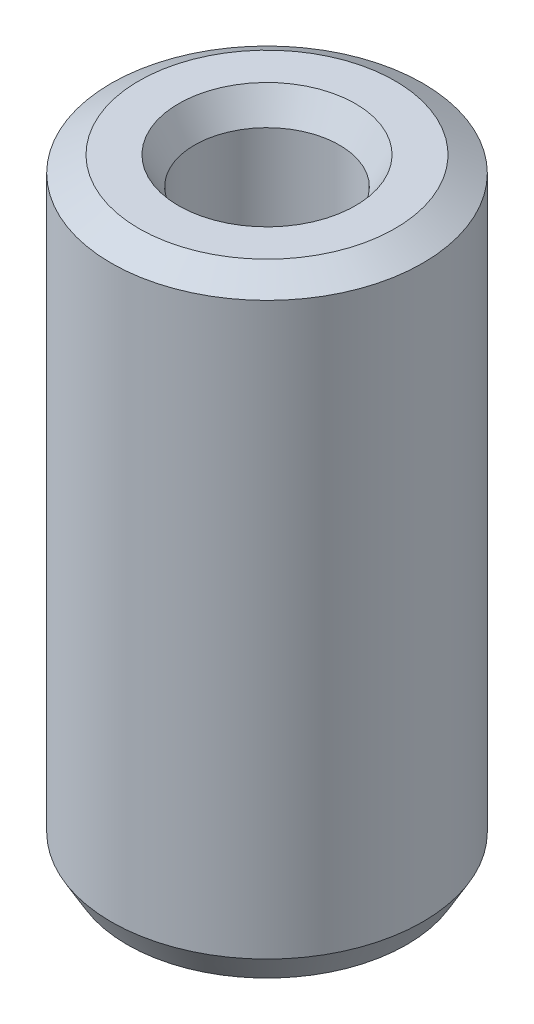
ISO-10303-21;
HEADER;
FILE_DESCRIPTION(('STEP AP214'),'2;1');
FILE_NAME('part.step','',(''),(''),'','','');
FILE_SCHEMA(('AUTOMOTIVE_DESIGN { 1 0 10303 214 1 1 1 1 }'));
ENDSEC;
DATA;
#1=APPLICATION_CONTEXT('core data for automotive mechanical design processes');
#2=APPLICATION_PROTOCOL_DEFINITION('international standard','automotive_design',2000,#1);
#3=PRODUCT_CONTEXT('',#1,'mechanical');
#4=PRODUCT('Part','Part','',(#3));
#5=PRODUCT_RELATED_PRODUCT_CATEGORY('part','',(#4));
#6=PRODUCT_DEFINITION_FORMATION('','',#4);
#7=PRODUCT_DEFINITION_CONTEXT('part definition',#1,'design');
#8=PRODUCT_DEFINITION('design','',#6,#7);
#9=PRODUCT_DEFINITION_SHAPE('','',#8);
#10=(LENGTH_UNIT() NAMED_UNIT(*) SI_UNIT(.MILLI.,.METRE.));
#11=(NAMED_UNIT(*) PLANE_ANGLE_UNIT() SI_UNIT($,.RADIAN.));
#12=(NAMED_UNIT(*) SI_UNIT($,.STERADIAN.) SOLID_ANGLE_UNIT());
#13=UNCERTAINTY_MEASURE_WITH_UNIT(LENGTH_MEASURE(1.E-05),#10,'distance_accuracy_value','');
#14=(GEOMETRIC_REPRESENTATION_CONTEXT(3) GLOBAL_UNCERTAINTY_ASSIGNED_CONTEXT((#13)) GLOBAL_UNIT_ASSIGNED_CONTEXT((#10,
#11,#12)) REPRESENTATION_CONTEXT('',''));
#15=CARTESIAN_POINT('',(0.,0.,0.));
#16=DIRECTION('',(0.,0.,1.));
#17=DIRECTION('',(1.,0.,0.));
#18=AXIS2_PLACEMENT_3D('',#15,#16,#17);
#19=CARTESIAN_POINT('',(0.,19.7141587701848,0.));
#20=DIRECTION('',(0.,-1.,0.));
#21=DIRECTION('',(0.,0.,-1.));
#22=AXIS2_PLACEMENT_3D('',#19,#20,#21);
#23=CYLINDRICAL_SURFACE('',#22,5.);
#24=CARTESIAN_POINT('',(0.,0.891876254664008,0.));
#25=DIRECTION('',(0.,1.,0.));
#26=DIRECTION('',(0.,0.,1.));
#27=AXIS2_PLACEMENT_3D('',#24,#25,#26);
#28=CIRCLE('',#27,5.);
#29=CARTESIAN_POINT('',(0.,0.891876254664008,5.));
#30=VERTEX_POINT('',#29);
#31=EDGE_CURVE('E10',#30,#30,#28,.T.);
#32=ORIENTED_EDGE('',*,*,#31,.T.);
#33=EDGE_LOOP('',(#32));
#34=FACE_BOUND('',#33,.T.);
#35=CARTESIAN_POINT('',(0.,19.1992337744707,0.));
#36=DIRECTION('',(0.,1.,0.));
#37=DIRECTION('',(0.,0.,1.));
#38=AXIS2_PLACEMENT_3D('',#35,#36,#37);
#39=CIRCLE('',#38,5.);
#40=CARTESIAN_POINT('',(0.,19.1992337744707,5.));
#41=VERTEX_POINT('',#40);
#42=EDGE_CURVE('E50',#41,#41,#39,.F.);
#43=ORIENTED_EDGE('',*,*,#42,.T.);
#44=EDGE_LOOP('',(#43));
#45=FACE_BOUND('',#44,.T.);
#46=ADVANCED_FACE('F39',(#34,#45),#23,.T.);
#47=CARTESIAN_POINT('',(0.,19.7141587701848,0.));
#48=DIRECTION('',(0.,1.,0.));
#49=DIRECTION('',(0.,0.,1.));
#50=AXIS2_PLACEMENT_3D('',#47,#48,#49);
#51=PLANE('',#50);
#52=CARTESIAN_POINT('',(0.,19.7141587701848,0.));
#53=DIRECTION('',(0.,1.,0.));
#54=DIRECTION('',(0.,0.,1.));
#55=AXIS2_PLACEMENT_3D('',#52,#53,#54);
#56=CIRCLE('',#55,2.83852982267749);
#57=CARTESIAN_POINT('',(0.,19.7141587701848,2.83852982267749));
#58=VERTEX_POINT('',#57);
#59=EDGE_CURVE('E58',#58,#58,#56,.F.);
#60=ORIENTED_EDGE('',*,*,#59,.T.);
#61=EDGE_LOOP('',(#60));
#62=FACE_BOUND('',#61,.T.);
#63=CARTESIAN_POINT('',(0.,19.7141587701848,0.));
#64=DIRECTION('',(0.,1.,0.));
#65=DIRECTION('',(0.,0.,1.));
#66=AXIS2_PLACEMENT_3D('',#63,#64,#65);
#67=CIRCLE('',#66,4.10812374533599);
#68=CARTESIAN_POINT('',(0.,19.7141587701848,4.10812374533599));
#69=VERTEX_POINT('',#68);
#70=EDGE_CURVE('E61',#69,#69,#67,.T.);
#71=ORIENTED_EDGE('',*,*,#70,.T.);
#72=EDGE_LOOP('',(#71));
#73=FACE_BOUND('',#72,.T.);
#74=ADVANCED_FACE('F88',(#62,#73),#51,.T.);
#75=CARTESIAN_POINT('',(0.,0.,0.));
#76=DIRECTION('',(0.,1.,0.));
#77=DIRECTION('',(0.,0.,1.));
#78=AXIS2_PLACEMENT_3D('',#75,#76,#77);
#79=PLANE('',#78);
#80=CARTESIAN_POINT('',(0.,0.,0.));
#81=DIRECTION('',(0.,1.,0.));
#82=DIRECTION('',(0.,0.,1.));
#83=AXIS2_PLACEMENT_3D('',#80,#81,#82);
#84=CIRCLE('',#83,3.2154810816274);
#85=CARTESIAN_POINT('',(0.,0.,3.2154810816274));
#86=VERTEX_POINT('',#85);
#87=EDGE_CURVE('E51',#86,#86,#84,.T.);
#88=ORIENTED_EDGE('',*,*,#87,.T.);
#89=EDGE_LOOP('',(#88));
#90=FACE_BOUND('',#89,.T.);
#91=CARTESIAN_POINT('',(0.,0.,0.));
#92=DIRECTION('',(0.,1.,0.));
#93=DIRECTION('',(0.,0.,1.));
#94=AXIS2_PLACEMENT_3D('',#91,#92,#93);
#95=CIRCLE('',#94,4.48507500428589);
#96=CARTESIAN_POINT('',(0.,0.,4.48507500428589));
#97=VERTEX_POINT('',#96);
#98=EDGE_CURVE('E54',#97,#97,#95,.F.);
#99=ORIENTED_EDGE('',*,*,#98,.T.);
#100=EDGE_LOOP('',(#99));
#101=FACE_BOUND('',#100,.T.);
#102=ADVANCED_FACE('F83',(#90,#101),#79,.F.);
#103=CARTESIAN_POINT('',(0.,19.7141587701848,0.));
#104=DIRECTION('',(0.,-1.,0.));
#105=DIRECTION('',(0.,0.,-1.));
#106=AXIS2_PLACEMENT_3D('',#103,#104,#105);
#107=CYLINDRICAL_SURFACE('',#106,2.3236048269634);
#108=CARTESIAN_POINT('',(0.,18.8222825155208,0.));
#109=DIRECTION('',(0.,1.,0.));
#110=DIRECTION('',(0.,0.,1.));
#111=AXIS2_PLACEMENT_3D('',#108,#109,#110);
#112=CIRCLE('',#111,2.3236048269634);
#113=CARTESIAN_POINT('',(0.,18.8222825155208,2.3236048269634));
#114=VERTEX_POINT('',#113);
#115=EDGE_CURVE('E67',#114,#114,#112,.T.);
#116=ORIENTED_EDGE('',*,*,#115,.T.);
#117=EDGE_LOOP('',(#116));
#118=FACE_BOUND('',#117,.T.);
#119=CARTESIAN_POINT('',(0.,0.514924995714101,0.));
#120=DIRECTION('',(0.,1.,0.));
#121=DIRECTION('',(0.,0.,1.));
#122=AXIS2_PLACEMENT_3D('',#119,#120,#121);
#123=CIRCLE('',#122,2.3236048269634);
#124=CARTESIAN_POINT('',(0.,0.514924995714101,2.3236048269634));
#125=VERTEX_POINT('',#124);
#126=EDGE_CURVE('E69',#125,#125,#123,.F.);
#127=ORIENTED_EDGE('',*,*,#126,.T.);
#128=EDGE_LOOP('',(#127));
#129=FACE_BOUND('',#128,.T.);
#130=ADVANCED_FACE('F71',(#118,#129),#107,.F.);
#131=CARTESIAN_POINT('',(0.,18.8222825155208,0.));
#132=DIRECTION('',(0.,1.,0.));
#133=DIRECTION('',(0.,0.,1.));
#134=AXIS2_PLACEMENT_3D('',#131,#132,#133);
#135=CONICAL_SURFACE('',#134,2.3236048269634,0.523598775598305);
#136=ORIENTED_EDGE('',*,*,#59,.F.);
#137=EDGE_LOOP('',(#136));
#138=FACE_BOUND('',#137,.T.);
#139=ORIENTED_EDGE('',*,*,#115,.F.);
#140=EDGE_LOOP('',(#139));
#141=FACE_BOUND('',#140,.T.);
#142=ADVANCED_FACE('F77',(#138,#141),#135,.F.);
#143=CARTESIAN_POINT('',(0.,0.,0.));
#144=DIRECTION('',(0.,-1.,0.));
#145=DIRECTION('',(0.,0.,-1.));
#146=AXIS2_PLACEMENT_3D('',#143,#144,#145);
#147=CONICAL_SURFACE('',#146,3.2154810816274,1.04719755119659);
#148=ORIENTED_EDGE('',*,*,#126,.F.);
#149=EDGE_LOOP('',(#148));
#150=FACE_BOUND('',#149,.T.);
#151=ORIENTED_EDGE('',*,*,#87,.F.);
#152=EDGE_LOOP('',(#151));
#153=FACE_BOUND('',#152,.T.);
#154=ADVANCED_FACE('F73',(#150,#153),#147,.F.);
#155=CARTESIAN_POINT('',(0.,0.891876254664008,0.));
#156=DIRECTION('',(0.,1.,0.));
#157=DIRECTION('',(0.,0.,1.));
#158=AXIS2_PLACEMENT_3D('',#155,#156,#157);
#159=CONICAL_SURFACE('',#158,5.,0.523598775598304);
#160=ORIENTED_EDGE('',*,*,#98,.F.);
#161=EDGE_LOOP('',(#160));
#162=FACE_BOUND('',#161,.T.);
#163=ORIENTED_EDGE('',*,*,#31,.F.);
#164=EDGE_LOOP('',(#163));
#165=FACE_BOUND('',#164,.T.);
#166=ADVANCED_FACE('F76',(#162,#165),#159,.T.);
#167=CARTESIAN_POINT('',(0.,19.7141587701848,0.));
#168=DIRECTION('',(0.,-1.,0.));
#169=DIRECTION('',(0.,0.,-1.));
#170=AXIS2_PLACEMENT_3D('',#167,#168,#169);
#171=CONICAL_SURFACE('',#170,4.10812374533599,1.0471975511966);
#172=ORIENTED_EDGE('',*,*,#42,.F.);
#173=EDGE_LOOP('',(#172));
#174=FACE_BOUND('',#173,.T.);
#175=ORIENTED_EDGE('',*,*,#70,.F.);
#176=EDGE_LOOP('',(#175));
#177=FACE_BOUND('',#176,.T.);
#178=ADVANCED_FACE('F45',(#174,#177),#171,.T.);
#179=CLOSED_SHELL('',(#46,#74,#102,#130,#142,#154,#166,#178));
#180=MANIFOLD_SOLID_BREP('B2',#179);
#181=ADVANCED_BREP_SHAPE_REPRESENTATION('',(#18,#180),#14);
#182=SHAPE_DEFINITION_REPRESENTATION(#9,#181);
ENDSEC;
END-ISO-10303-21;
